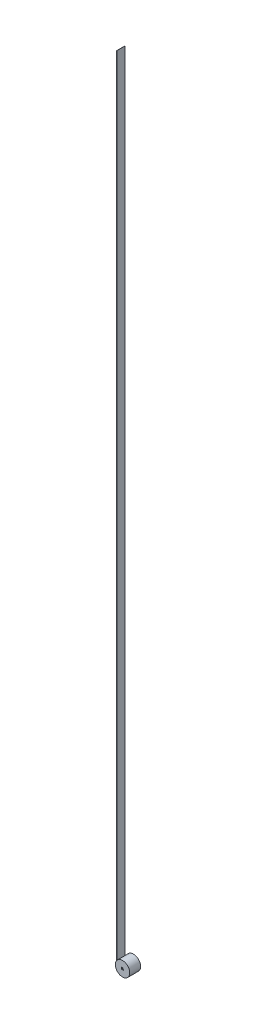
ISO-10303-21;
HEADER;
FILE_DESCRIPTION(('STEP AP214'),'2;1');
FILE_NAME('part.step','',(''),(''),'','','');
FILE_SCHEMA(('AUTOMOTIVE_DESIGN { 1 0 10303 214 1 1 1 1 }'));
ENDSEC;
DATA;
#1=APPLICATION_CONTEXT('core data for automotive mechanical design processes');
#2=APPLICATION_PROTOCOL_DEFINITION('international standard','automotive_design',2000,#1);
#3=PRODUCT_CONTEXT('',#1,'mechanical');
#4=PRODUCT('Part','Part','',(#3));
#5=PRODUCT_RELATED_PRODUCT_CATEGORY('part','',(#4));
#6=PRODUCT_DEFINITION_FORMATION('','',#4);
#7=PRODUCT_DEFINITION_CONTEXT('part definition',#1,'design');
#8=PRODUCT_DEFINITION('design','',#6,#7);
#9=PRODUCT_DEFINITION_SHAPE('','',#8);
#10=(LENGTH_UNIT() NAMED_UNIT(*) SI_UNIT(.MILLI.,.METRE.));
#11=(NAMED_UNIT(*) PLANE_ANGLE_UNIT() SI_UNIT($,.RADIAN.));
#12=(NAMED_UNIT(*) SI_UNIT($,.STERADIAN.) SOLID_ANGLE_UNIT());
#13=UNCERTAINTY_MEASURE_WITH_UNIT(LENGTH_MEASURE(1.E-05),#10,'distance_accuracy_value','');
#14=(GEOMETRIC_REPRESENTATION_CONTEXT(3) GLOBAL_UNCERTAINTY_ASSIGNED_CONTEXT((#13)) GLOBAL_UNIT_ASSIGNED_CONTEXT((#10,
#11,#12)) REPRESENTATION_CONTEXT('',''));
#15=CARTESIAN_POINT('',(0.,0.,0.));
#16=DIRECTION('',(0.,0.,1.));
#17=DIRECTION('',(1.,0.,0.));
#18=AXIS2_PLACEMENT_3D('',#15,#16,#17);
#19=CARTESIAN_POINT('',(-28.65,3106.,5.62500000000001));
#20=DIRECTION('',(0.,0.,1.));
#21=DIRECTION('',(1.,0.,0.));
#22=AXIS2_PLACEMENT_3D('',#19,#20,#21);
#23=PLANE('',#22);
#24=DIRECTION('',(-1.,0.,0.));
#25=VECTOR('',#24,1.);
#26=CARTESIAN_POINT('',(-28.65,0.,5.62500000000001));
#27=LINE('',#26,#25);
#28=CARTESIAN_POINT('',(-28.25,0.,5.625));
#29=VERTEX_POINT('',#28);
#30=CARTESIAN_POINT('',(-28.65,0.,5.62500000000001));
#31=VERTEX_POINT('',#30);
#32=EDGE_CURVE('E112',#29,#31,#27,.T.);
#33=ORIENTED_EDGE('',*,*,#32,.T.);
#34=DIRECTION('',(0.,-1.,0.));
#35=VECTOR('',#34,1.);
#36=CARTESIAN_POINT('',(-28.65,3106.,5.62500000000001));
#37=LINE('',#36,#35);
#38=CARTESIAN_POINT('',(-28.65,3106.,5.62500000000001));
#39=VERTEX_POINT('',#38);
#40=EDGE_CURVE('E12',#39,#31,#37,.T.);
#41=ORIENTED_EDGE('',*,*,#40,.F.);
#42=DIRECTION('',(-1.,0.,0.));
#43=VECTOR('',#42,1.);
#44=CARTESIAN_POINT('',(-28.65,3106.,5.62500000000001));
#45=LINE('',#44,#43);
#46=CARTESIAN_POINT('',(-28.25,3106.,5.625));
#47=VERTEX_POINT('',#46);
#48=EDGE_CURVE('E100',#47,#39,#45,.T.);
#49=ORIENTED_EDGE('',*,*,#48,.F.);
#50=DIRECTION('',(0.,-1.,0.));
#51=VECTOR('',#50,1.);
#52=CARTESIAN_POINT('',(-28.25,3106.,5.625));
#53=LINE('',#52,#51);
#54=EDGE_CURVE('E108',#47,#29,#53,.T.);
#55=ORIENTED_EDGE('',*,*,#54,.T.);
#56=EDGE_LOOP('',(#33,#41,#49,#55));
#57=FACE_BOUND('',#56,.T.);
#58=ADVANCED_FACE('F49',(#57),#23,.F.);
#59=CARTESIAN_POINT('',(-28.65,3106.,37.375));
#60=DIRECTION('',(1.,0.,0.));
#61=DIRECTION('',(0.,0.,-1.));
#62=AXIS2_PLACEMENT_3D('',#59,#60,#61);
#63=PLANE('',#62);
#64=DIRECTION('',(0.,0.,1.));
#65=VECTOR('',#64,1.);
#66=CARTESIAN_POINT('',(-28.65,0.,37.375));
#67=LINE('',#66,#65);
#68=CARTESIAN_POINT('',(-28.65,0.,37.375));
#69=VERTEX_POINT('',#68);
#70=EDGE_CURVE('E104',#31,#69,#67,.T.);
#71=ORIENTED_EDGE('',*,*,#70,.T.);
#72=DIRECTION('',(0.,-1.,0.));
#73=VECTOR('',#72,1.);
#74=CARTESIAN_POINT('',(-28.65,3106.,37.375));
#75=LINE('',#74,#73);
#76=CARTESIAN_POINT('',(-28.65,3106.,37.375));
#77=VERTEX_POINT('',#76);
#78=EDGE_CURVE('E57',#77,#69,#75,.T.);
#79=ORIENTED_EDGE('',*,*,#78,.F.);
#80=DIRECTION('',(0.,0.,1.));
#81=VECTOR('',#80,1.);
#82=CARTESIAN_POINT('',(-28.65,3106.,37.375));
#83=LINE('',#82,#81);
#84=EDGE_CURVE('E95',#39,#77,#83,.T.);
#85=ORIENTED_EDGE('',*,*,#84,.F.);
#86=ORIENTED_EDGE('',*,*,#40,.T.);
#87=EDGE_LOOP('',(#71,#79,#85,#86));
#88=FACE_BOUND('',#87,.T.);
#89=ADVANCED_FACE('F103',(#88),#63,.F.);
#90=CARTESIAN_POINT('',(-28.25,3106.,37.375));
#91=DIRECTION('',(0.,0.,-1.));
#92=DIRECTION('',(-1.,0.,0.));
#93=AXIS2_PLACEMENT_3D('',#90,#91,#92);
#94=PLANE('',#93);
#95=DIRECTION('',(1.,0.,0.));
#96=VECTOR('',#95,1.);
#97=CARTESIAN_POINT('',(-28.25,0.,37.375));
#98=LINE('',#97,#96);
#99=CARTESIAN_POINT('',(-28.25,0.,37.375));
#100=VERTEX_POINT('',#99);
#101=EDGE_CURVE('E82',#69,#100,#98,.T.);
#102=ORIENTED_EDGE('',*,*,#101,.T.);
#103=DIRECTION('',(0.,-1.,0.));
#104=VECTOR('',#103,1.);
#105=CARTESIAN_POINT('',(-28.25,3106.,37.375));
#106=LINE('',#105,#104);
#107=CARTESIAN_POINT('',(-28.25,3106.,37.375));
#108=VERTEX_POINT('',#107);
#109=EDGE_CURVE('E105',#108,#100,#106,.T.);
#110=ORIENTED_EDGE('',*,*,#109,.F.);
#111=DIRECTION('',(1.,0.,0.));
#112=VECTOR('',#111,1.);
#113=CARTESIAN_POINT('',(-28.25,3106.,37.375));
#114=LINE('',#113,#112);
#115=EDGE_CURVE('E98',#77,#108,#114,.T.);
#116=ORIENTED_EDGE('',*,*,#115,.F.);
#117=ORIENTED_EDGE('',*,*,#78,.T.);
#118=EDGE_LOOP('',(#102,#110,#116,#117));
#119=FACE_BOUND('',#118,.T.);
#120=ADVANCED_FACE('F106',(#119),#94,.F.);
#121=CARTESIAN_POINT('',(-28.25,3106.,5.625));
#122=DIRECTION('',(-1.,0.,0.));
#123=DIRECTION('',(0.,0.,1.));
#124=AXIS2_PLACEMENT_3D('',#121,#122,#123);
#125=PLANE('',#124);
#126=DIRECTION('',(0.,0.,-1.));
#127=VECTOR('',#126,1.);
#128=CARTESIAN_POINT('',(-28.25,0.,5.625));
#129=LINE('',#128,#127);
#130=EDGE_CURVE('E88',#100,#29,#129,.T.);
#131=ORIENTED_EDGE('',*,*,#130,.T.);
#132=ORIENTED_EDGE('',*,*,#54,.F.);
#133=DIRECTION('',(0.,0.,-1.));
#134=VECTOR('',#133,1.);
#135=CARTESIAN_POINT('',(-28.25,3106.,5.625));
#136=LINE('',#135,#134);
#137=EDGE_CURVE('E65',#108,#47,#136,.T.);
#138=ORIENTED_EDGE('',*,*,#137,.F.);
#139=ORIENTED_EDGE('',*,*,#109,.T.);
#140=EDGE_LOOP('',(#131,#132,#138,#139));
#141=FACE_BOUND('',#140,.T.);
#142=ADVANCED_FACE('F119',(#141),#125,.F.);
#143=CARTESIAN_POINT('',(0.,3106.,0.));
#144=DIRECTION('',(0.,-1.,0.));
#145=DIRECTION('',(0.,0.,-1.));
#146=AXIS2_PLACEMENT_3D('',#143,#144,#145);
#147=PLANE('',#146);
#148=ORIENTED_EDGE('',*,*,#48,.T.);
#149=ORIENTED_EDGE('',*,*,#84,.T.);
#150=ORIENTED_EDGE('',*,*,#115,.T.);
#151=ORIENTED_EDGE('',*,*,#137,.T.);
#152=EDGE_LOOP('',(#148,#149,#150,#151));
#153=FACE_BOUND('',#152,.T.);
#154=ADVANCED_FACE('F96',(#153),#147,.F.);
#155=CARTESIAN_POINT('',(0.,0.,0.));
#156=DIRECTION('',(0.,-1.,0.));
#157=DIRECTION('',(0.,0.,-1.));
#158=AXIS2_PLACEMENT_3D('',#155,#156,#157);
#159=PLANE('',#158);
#160=ORIENTED_EDGE('',*,*,#32,.F.);
#161=ORIENTED_EDGE('',*,*,#130,.F.);
#162=ORIENTED_EDGE('',*,*,#101,.F.);
#163=ORIENTED_EDGE('',*,*,#70,.F.);
#164=EDGE_LOOP('',(#160,#161,#162,#163));
#165=FACE_BOUND('',#164,.T.);
#166=ADVANCED_FACE('F122',(#165),#159,.T.);
#167=CLOSED_SHELL('',(#58,#89,#120,#142,#154,#166));
#168=MANIFOLD_SOLID_BREP('B2',#167);
#169=CARTESIAN_POINT('',(0.,0.,43.));
#170=DIRECTION('',(0.,0.,-1.));
#171=DIRECTION('',(-1.,0.,0.));
#172=AXIS2_PLACEMENT_3D('',#169,#170,#171);
#173=CYLINDRICAL_SURFACE('',#172,28.25);
#174=CARTESIAN_POINT('',(0.,0.,43.));
#175=DIRECTION('',(0.,0.,1.));
#176=DIRECTION('',(1.,0.,0.));
#177=AXIS2_PLACEMENT_3D('',#174,#175,#176);
#178=CIRCLE('',#177,28.25);
#179=CARTESIAN_POINT('',(28.25,0.,43.));
#180=VERTEX_POINT('',#179);
#181=EDGE_CURVE('E47',#180,#180,#178,.T.);
#182=ORIENTED_EDGE('',*,*,#181,.F.);
#183=EDGE_LOOP('',(#182));
#184=FACE_BOUND('',#183,.T.);
#185=CARTESIAN_POINT('',(0.,0.,0.));
#186=DIRECTION('',(0.,0.,1.));
#187=DIRECTION('',(1.,0.,0.));
#188=AXIS2_PLACEMENT_3D('',#185,#186,#187);
#189=CIRCLE('',#188,28.25);
#190=CARTESIAN_POINT('',(28.25,0.,0.));
#191=VERTEX_POINT('',#190);
#192=EDGE_CURVE('E176',#191,#191,#189,.T.);
#193=ORIENTED_EDGE('',*,*,#192,.T.);
#194=EDGE_LOOP('',(#193));
#195=FACE_BOUND('',#194,.T.);
#196=ADVANCED_FACE('F173',(#184,#195),#173,.T.);
#197=CARTESIAN_POINT('',(0.,0.,43.));
#198=DIRECTION('',(0.,0.,1.));
#199=DIRECTION('',(1.,0.,0.));
#200=AXIS2_PLACEMENT_3D('',#197,#198,#199);
#201=PLANE('',#200);
#202=DIRECTION('',(0.,-1.,0.));
#203=VECTOR('',#202,1.);
#204=CARTESIAN_POINT('',(-4.,-4.,43.));
#205=LINE('',#204,#203);
#206=CARTESIAN_POINT('',(-4.,4.,43.));
#207=VERTEX_POINT('',#206);
#208=CARTESIAN_POINT('',(-4.,-4.,43.));
#209=VERTEX_POINT('',#208);
#210=EDGE_CURVE('E188',#207,#209,#205,.T.);
#211=ORIENTED_EDGE('',*,*,#210,.F.);
#212=DIRECTION('',(-1.,0.,0.));
#213=VECTOR('',#212,1.);
#214=CARTESIAN_POINT('',(4.,4.,43.));
#215=LINE('',#214,#213);
#216=CARTESIAN_POINT('',(4.,4.,43.));
#217=VERTEX_POINT('',#216);
#218=EDGE_CURVE('E243',#217,#207,#215,.T.);
#219=ORIENTED_EDGE('',*,*,#218,.F.);
#220=DIRECTION('',(0.,1.,0.));
#221=VECTOR('',#220,1.);
#222=CARTESIAN_POINT('',(4.,-4.,43.));
#223=LINE('',#222,#221);
#224=CARTESIAN_POINT('',(4.,-4.,43.));
#225=VERTEX_POINT('',#224);
#226=EDGE_CURVE('E252',#225,#217,#223,.T.);
#227=ORIENTED_EDGE('',*,*,#226,.F.);
#228=DIRECTION('',(1.,0.,0.));
#229=VECTOR('',#228,1.);
#230=CARTESIAN_POINT('',(4.,-4.,43.));
#231=LINE('',#230,#229);
#232=EDGE_CURVE('E223',#209,#225,#231,.T.);
#233=ORIENTED_EDGE('',*,*,#232,.F.);
#234=EDGE_LOOP('',(#211,#219,#227,#233));
#235=FACE_BOUND('',#234,.T.);
#236=ORIENTED_EDGE('',*,*,#181,.T.);
#237=EDGE_LOOP('',(#236));
#238=FACE_BOUND('',#237,.T.);
#239=ADVANCED_FACE('F263',(#235,#238),#201,.T.);
#240=CARTESIAN_POINT('',(0.,0.,0.));
#241=DIRECTION('',(0.,0.,1.));
#242=DIRECTION('',(1.,0.,0.));
#243=AXIS2_PLACEMENT_3D('',#240,#241,#242);
#244=PLANE('',#243);
#245=ORIENTED_EDGE('',*,*,#192,.F.);
#246=EDGE_LOOP('',(#245));
#247=FACE_BOUND('',#246,.T.);
#248=ADVANCED_FACE('F275',(#247),#244,.F.);
#249=CARTESIAN_POINT('',(-4.,-4.,39.5));
#250=DIRECTION('',(-1.,0.,0.));
#251=DIRECTION('',(0.,0.,1.));
#252=AXIS2_PLACEMENT_3D('',#249,#250,#251);
#253=PLANE('',#252);
#254=ORIENTED_EDGE('',*,*,#210,.T.);
#255=DIRECTION('',(0.,0.,1.));
#256=VECTOR('',#255,1.);
#257=CARTESIAN_POINT('',(-4.,-4.,39.5));
#258=LINE('',#257,#256);
#259=CARTESIAN_POINT('',(-4.,-4.,39.5));
#260=VERTEX_POINT('',#259);
#261=EDGE_CURVE('E211',#260,#209,#258,.T.);
#262=ORIENTED_EDGE('',*,*,#261,.F.);
#263=DIRECTION('',(0.,-1.,0.));
#264=VECTOR('',#263,1.);
#265=CARTESIAN_POINT('',(-4.,-4.,39.5));
#266=LINE('',#265,#264);
#267=CARTESIAN_POINT('',(-4.,4.,39.5));
#268=VERTEX_POINT('',#267);
#269=EDGE_CURVE('E239',#268,#260,#266,.T.);
#270=ORIENTED_EDGE('',*,*,#269,.F.);
#271=DIRECTION('',(0.,0.,1.));
#272=VECTOR('',#271,1.);
#273=CARTESIAN_POINT('',(-4.,4.,39.5));
#274=LINE('',#273,#272);
#275=EDGE_CURVE('E196',#268,#207,#274,.T.);
#276=ORIENTED_EDGE('',*,*,#275,.T.);
#277=EDGE_LOOP('',(#254,#262,#270,#276));
#278=FACE_BOUND('',#277,.T.);
#279=ADVANCED_FACE('F268',(#278),#253,.F.);
#280=CARTESIAN_POINT('',(4.,4.,39.5));
#281=DIRECTION('',(0.,1.,0.));
#282=DIRECTION('',(0.,0.,1.));
#283=AXIS2_PLACEMENT_3D('',#280,#281,#282);
#284=PLANE('',#283);
#285=ORIENTED_EDGE('',*,*,#218,.T.);
#286=ORIENTED_EDGE('',*,*,#275,.F.);
#287=DIRECTION('',(-1.,0.,0.));
#288=VECTOR('',#287,1.);
#289=CARTESIAN_POINT('',(4.,4.,39.5));
#290=LINE('',#289,#288);
#291=CARTESIAN_POINT('',(4.,4.,39.5));
#292=VERTEX_POINT('',#291);
#293=EDGE_CURVE('E236',#292,#268,#290,.T.);
#294=ORIENTED_EDGE('',*,*,#293,.F.);
#295=DIRECTION('',(0.,0.,1.));
#296=VECTOR('',#295,1.);
#297=CARTESIAN_POINT('',(4.,4.,39.5));
#298=LINE('',#297,#296);
#299=EDGE_CURVE('E228',#292,#217,#298,.T.);
#300=ORIENTED_EDGE('',*,*,#299,.T.);
#301=EDGE_LOOP('',(#285,#286,#294,#300));
#302=FACE_BOUND('',#301,.T.);
#303=ADVANCED_FACE('F266',(#302),#284,.F.);
#304=CARTESIAN_POINT('',(4.,-4.,39.5));
#305=DIRECTION('',(1.,0.,0.));
#306=DIRECTION('',(0.,0.,-1.));
#307=AXIS2_PLACEMENT_3D('',#304,#305,#306);
#308=PLANE('',#307);
#309=ORIENTED_EDGE('',*,*,#226,.T.);
#310=ORIENTED_EDGE('',*,*,#299,.F.);
#311=DIRECTION('',(0.,1.,0.));
#312=VECTOR('',#311,1.);
#313=CARTESIAN_POINT('',(4.,-4.,39.5));
#314=LINE('',#313,#312);
#315=CARTESIAN_POINT('',(4.,-4.,39.5));
#316=VERTEX_POINT('',#315);
#317=EDGE_CURVE('E231',#316,#292,#314,.T.);
#318=ORIENTED_EDGE('',*,*,#317,.F.);
#319=DIRECTION('',(0.,0.,1.));
#320=VECTOR('',#319,1.);
#321=CARTESIAN_POINT('',(4.,-4.,39.5));
#322=LINE('',#321,#320);
#323=EDGE_CURVE('E216',#316,#225,#322,.T.);
#324=ORIENTED_EDGE('',*,*,#323,.T.);
#325=EDGE_LOOP('',(#309,#310,#318,#324));
#326=FACE_BOUND('',#325,.T.);
#327=ADVANCED_FACE('F232',(#326),#308,.F.);
#328=CARTESIAN_POINT('',(4.,-4.,39.5));
#329=DIRECTION('',(0.,-1.,0.));
#330=DIRECTION('',(0.,0.,-1.));
#331=AXIS2_PLACEMENT_3D('',#328,#329,#330);
#332=PLANE('',#331);
#333=ORIENTED_EDGE('',*,*,#232,.T.);
#334=ORIENTED_EDGE('',*,*,#323,.F.);
#335=DIRECTION('',(1.,0.,0.));
#336=VECTOR('',#335,1.);
#337=CARTESIAN_POINT('',(4.,-4.,39.5));
#338=LINE('',#337,#336);
#339=EDGE_CURVE('E220',#260,#316,#338,.T.);
#340=ORIENTED_EDGE('',*,*,#339,.F.);
#341=ORIENTED_EDGE('',*,*,#261,.T.);
#342=EDGE_LOOP('',(#333,#334,#340,#341));
#343=FACE_BOUND('',#342,.T.);
#344=ADVANCED_FACE('F218',(#343),#332,.F.);
#345=CARTESIAN_POINT('',(0.,0.,39.5));
#346=DIRECTION('',(0.,0.,1.));
#347=DIRECTION('',(1.,0.,0.));
#348=AXIS2_PLACEMENT_3D('',#345,#346,#347);
#349=PLANE('',#348);
#350=ORIENTED_EDGE('',*,*,#269,.T.);
#351=ORIENTED_EDGE('',*,*,#339,.T.);
#352=ORIENTED_EDGE('',*,*,#317,.T.);
#353=ORIENTED_EDGE('',*,*,#293,.T.);
#354=EDGE_LOOP('',(#350,#351,#352,#353));
#355=FACE_BOUND('',#354,.T.);
#356=ADVANCED_FACE('F238',(#355),#349,.T.);
#357=CLOSED_SHELL('',(#196,#239,#248,#279,#303,#327,#344,#356));
#358=MANIFOLD_SOLID_BREP('B6',#357);
#359=ADVANCED_BREP_SHAPE_REPRESENTATION('',(#18,#168,#358),#14);
#360=SHAPE_DEFINITION_REPRESENTATION(#9,#359);
ENDSEC;
END-ISO-10303-21;
